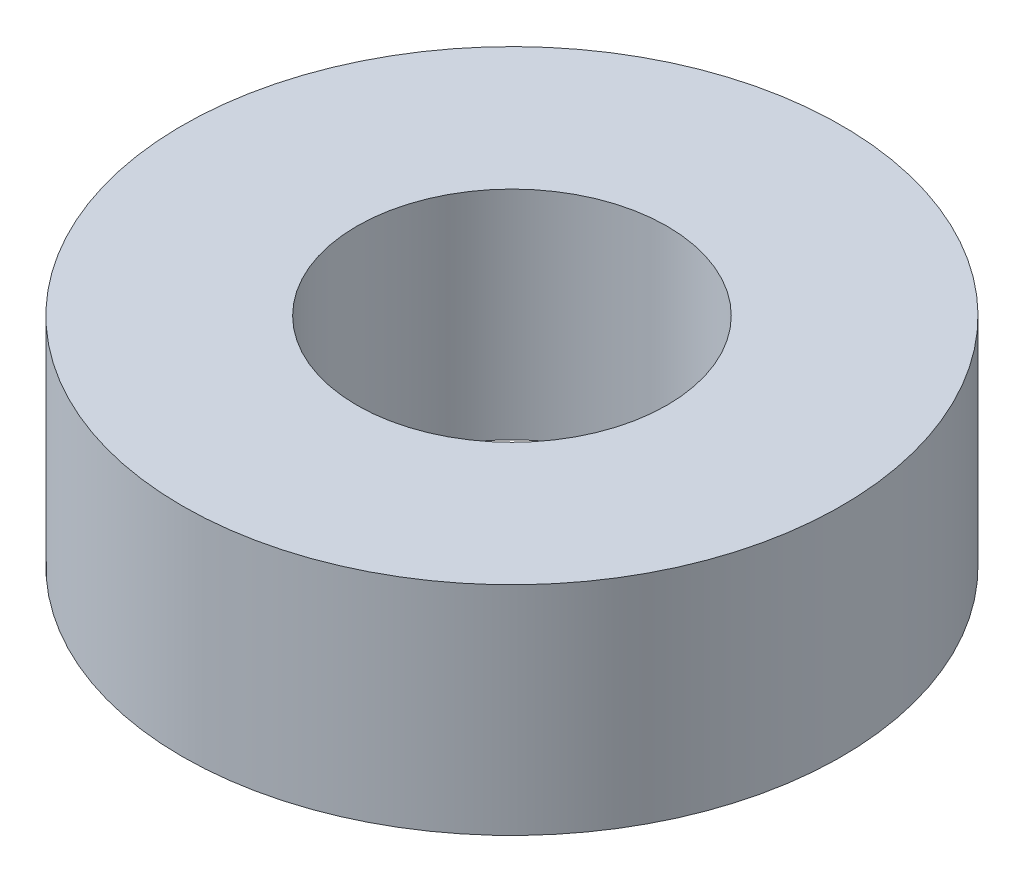
ISO-10303-21;
HEADER;
FILE_DESCRIPTION(('STEP AP214'),'2;1');
FILE_NAME('part.step','',(''),(''),'','','');
FILE_SCHEMA(('AUTOMOTIVE_DESIGN { 1 0 10303 214 1 1 1 1 }'));
ENDSEC;
DATA;
#1=APPLICATION_CONTEXT('core data for automotive mechanical design processes');
#2=APPLICATION_PROTOCOL_DEFINITION('international standard','automotive_design',2000,#1);
#3=PRODUCT_CONTEXT('',#1,'mechanical');
#4=PRODUCT('Part','Part','',(#3));
#5=PRODUCT_RELATED_PRODUCT_CATEGORY('part','',(#4));
#6=PRODUCT_DEFINITION_FORMATION('','',#4);
#7=PRODUCT_DEFINITION_CONTEXT('part definition',#1,'design');
#8=PRODUCT_DEFINITION('design','',#6,#7);
#9=PRODUCT_DEFINITION_SHAPE('','',#8);
#10=(LENGTH_UNIT() NAMED_UNIT(*) SI_UNIT(.MILLI.,.METRE.));
#11=(NAMED_UNIT(*) PLANE_ANGLE_UNIT() SI_UNIT($,.RADIAN.));
#12=(NAMED_UNIT(*) SI_UNIT($,.STERADIAN.) SOLID_ANGLE_UNIT());
#13=UNCERTAINTY_MEASURE_WITH_UNIT(LENGTH_MEASURE(1.E-05),#10,'distance_accuracy_value','');
#14=(GEOMETRIC_REPRESENTATION_CONTEXT(3) GLOBAL_UNCERTAINTY_ASSIGNED_CONTEXT((#13)) GLOBAL_UNIT_ASSIGNED_CONTEXT((#10,
#11,#12)) REPRESENTATION_CONTEXT('',''));
#15=CARTESIAN_POINT('',(0.,0.,0.));
#16=DIRECTION('',(0.,0.,1.));
#17=DIRECTION('',(1.,0.,0.));
#18=AXIS2_PLACEMENT_3D('',#15,#16,#17);
#19=CARTESIAN_POINT('',(0.,28.,0.));
#20=DIRECTION('',(0.,-1.,0.));
#21=DIRECTION('',(0.,0.,-1.));
#22=AXIS2_PLACEMENT_3D('',#19,#20,#21);
#23=CYLINDRICAL_SURFACE('',#22,42.5);
#24=CARTESIAN_POINT('',(0.,28.,0.));
#25=DIRECTION('',(0.,1.,0.));
#26=DIRECTION('',(0.,0.,1.));
#27=AXIS2_PLACEMENT_3D('',#24,#25,#26);
#28=CIRCLE('',#27,42.5);
#29=CARTESIAN_POINT('',(0.,28.,42.5));
#30=VERTEX_POINT('',#29);
#31=EDGE_CURVE('E10',#30,#30,#28,.T.);
#32=ORIENTED_EDGE('',*,*,#31,.F.);
#33=EDGE_LOOP('',(#32));
#34=FACE_BOUND('',#33,.T.);
#35=CARTESIAN_POINT('',(0.,0.,0.));
#36=DIRECTION('',(0.,1.,0.));
#37=DIRECTION('',(0.,0.,1.));
#38=AXIS2_PLACEMENT_3D('',#35,#36,#37);
#39=CIRCLE('',#38,42.5);
#40=CARTESIAN_POINT('',(0.,0.,42.5));
#41=VERTEX_POINT('',#40);
#42=EDGE_CURVE('E37',#41,#41,#39,.T.);
#43=ORIENTED_EDGE('',*,*,#42,.T.);
#44=EDGE_LOOP('',(#43));
#45=FACE_BOUND('',#44,.T.);
#46=ADVANCED_FACE('F40',(#34,#45),#23,.T.);
#47=CARTESIAN_POINT('',(0.,28.,0.));
#48=DIRECTION('',(0.,1.,0.));
#49=DIRECTION('',(0.,0.,1.));
#50=AXIS2_PLACEMENT_3D('',#47,#48,#49);
#51=PLANE('',#50);
#52=CARTESIAN_POINT('',(0.,28.,0.));
#53=DIRECTION('',(0.,1.,0.));
#54=DIRECTION('',(0.,0.,1.));
#55=AXIS2_PLACEMENT_3D('',#52,#53,#54);
#56=CIRCLE('',#55,20.);
#57=CARTESIAN_POINT('',(0.,28.,20.));
#58=VERTEX_POINT('',#57);
#59=EDGE_CURVE('E50',#58,#58,#56,.T.);
#60=ORIENTED_EDGE('',*,*,#59,.F.);
#61=EDGE_LOOP('',(#60));
#62=FACE_BOUND('',#61,.T.);
#63=ORIENTED_EDGE('',*,*,#31,.T.);
#64=EDGE_LOOP('',(#63));
#65=FACE_BOUND('',#64,.T.);
#66=ADVANCED_FACE('F59',(#62,#65),#51,.T.);
#67=CARTESIAN_POINT('',(0.,0.,0.));
#68=DIRECTION('',(0.,1.,0.));
#69=DIRECTION('',(0.,0.,1.));
#70=AXIS2_PLACEMENT_3D('',#67,#68,#69);
#71=PLANE('',#70);
#72=CARTESIAN_POINT('',(0.,0.,0.));
#73=DIRECTION('',(0.,1.,0.));
#74=DIRECTION('',(0.,0.,1.));
#75=AXIS2_PLACEMENT_3D('',#72,#73,#74);
#76=CIRCLE('',#75,20.);
#77=CARTESIAN_POINT('',(0.,0.,20.));
#78=VERTEX_POINT('',#77);
#79=EDGE_CURVE('E47',#78,#78,#76,.T.);
#80=ORIENTED_EDGE('',*,*,#79,.T.);
#81=EDGE_LOOP('',(#80));
#82=FACE_BOUND('',#81,.T.);
#83=ORIENTED_EDGE('',*,*,#42,.F.);
#84=EDGE_LOOP('',(#83));
#85=FACE_BOUND('',#84,.T.);
#86=ADVANCED_FACE('F58',(#82,#85),#71,.F.);
#87=CARTESIAN_POINT('',(0.,28.,0.));
#88=DIRECTION('',(0.,-1.,0.));
#89=DIRECTION('',(0.,0.,-1.));
#90=AXIS2_PLACEMENT_3D('',#87,#88,#89);
#91=CYLINDRICAL_SURFACE('',#90,20.);
#92=ORIENTED_EDGE('',*,*,#59,.T.);
#93=EDGE_LOOP('',(#92));
#94=FACE_BOUND('',#93,.T.);
#95=ORIENTED_EDGE('',*,*,#79,.F.);
#96=EDGE_LOOP('',(#95));
#97=FACE_BOUND('',#96,.T.);
#98=ADVANCED_FACE('F54',(#94,#97),#91,.F.);
#99=CLOSED_SHELL('',(#46,#66,#86,#98));
#100=MANIFOLD_SOLID_BREP('B2',#99);
#101=ADVANCED_BREP_SHAPE_REPRESENTATION('',(#18,#100),#14);
#102=SHAPE_DEFINITION_REPRESENTATION(#9,#101);
ENDSEC;
END-ISO-10303-21;
